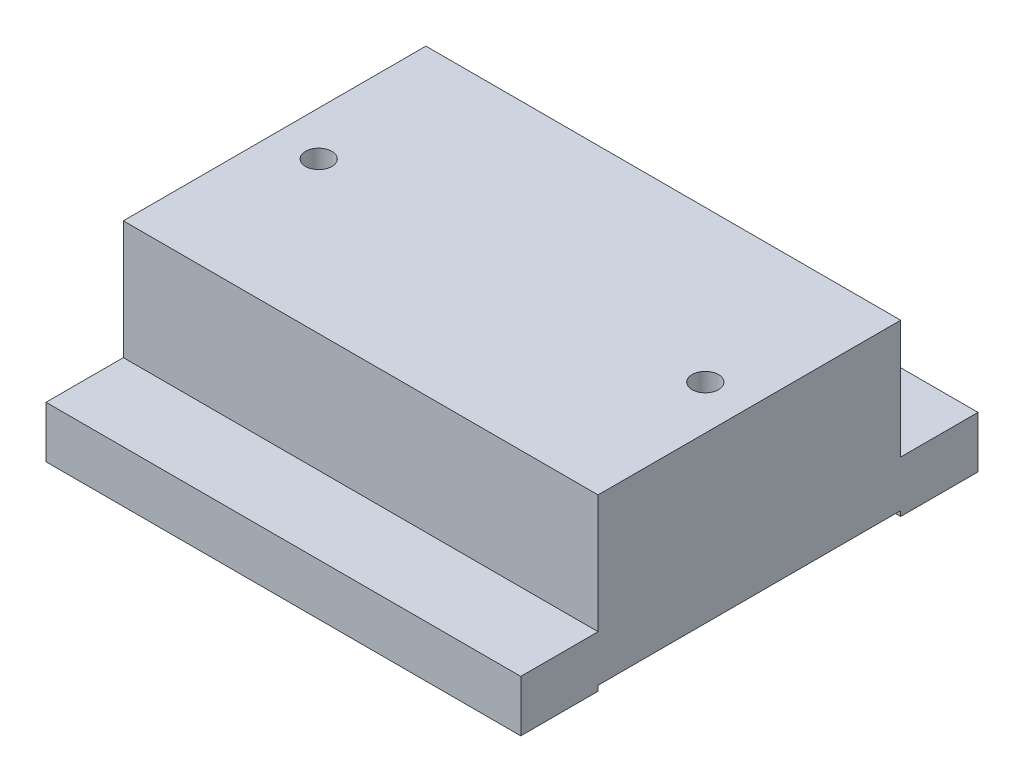
ISO-10303-21;
HEADER;
FILE_DESCRIPTION(('STEP AP214'),'2;1');
FILE_NAME('part.step','',(''),(''),'','','');
FILE_SCHEMA(('AUTOMOTIVE_DESIGN { 1 0 10303 214 1 1 1 1 }'));
ENDSEC;
DATA;
#1=APPLICATION_CONTEXT('core data for automotive mechanical design processes');
#2=APPLICATION_PROTOCOL_DEFINITION('international standard','automotive_design',2000,#1);
#3=PRODUCT_CONTEXT('',#1,'mechanical');
#4=PRODUCT('Part','Part','',(#3));
#5=PRODUCT_RELATED_PRODUCT_CATEGORY('part','',(#4));
#6=PRODUCT_DEFINITION_FORMATION('','',#4);
#7=PRODUCT_DEFINITION_CONTEXT('part definition',#1,'design');
#8=PRODUCT_DEFINITION('design','',#6,#7);
#9=PRODUCT_DEFINITION_SHAPE('','',#8);
#10=(LENGTH_UNIT() NAMED_UNIT(*) SI_UNIT(.MILLI.,.METRE.));
#11=(NAMED_UNIT(*) PLANE_ANGLE_UNIT() SI_UNIT($,.RADIAN.));
#12=(NAMED_UNIT(*) SI_UNIT($,.STERADIAN.) SOLID_ANGLE_UNIT());
#13=UNCERTAINTY_MEASURE_WITH_UNIT(LENGTH_MEASURE(1.E-05),#10,'distance_accuracy_value','');
#14=(GEOMETRIC_REPRESENTATION_CONTEXT(3) GLOBAL_UNCERTAINTY_ASSIGNED_CONTEXT((#13)) GLOBAL_UNIT_ASSIGNED_CONTEXT((#10,
#11,#12)) REPRESENTATION_CONTEXT('',''));
#15=CARTESIAN_POINT('',(0.,0.,0.));
#16=DIRECTION('',(0.,0.,1.));
#17=DIRECTION('',(1.,0.,0.));
#18=AXIS2_PLACEMENT_3D('',#15,#16,#17);
#19=CARTESIAN_POINT('',(46.05,0.,44.35));
#20=DIRECTION('',(0.,1.,0.));
#21=DIRECTION('',(0.,0.,1.));
#22=AXIS2_PLACEMENT_3D('',#19,#20,#21);
#23=PLANE('',#22);
#24=DIRECTION('',(0.,0.,-1.));
#25=VECTOR('',#24,1.);
#26=CARTESIAN_POINT('',(46.05,0.,-44.35));
#27=LINE('',#26,#25);
#28=CARTESIAN_POINT('',(46.05,0.,-29.35));
#29=VERTEX_POINT('',#28);
#30=CARTESIAN_POINT('',(46.05,0.,-44.35));
#31=VERTEX_POINT('',#30);
#32=EDGE_CURVE('E208',#29,#31,#27,.T.);
#33=ORIENTED_EDGE('',*,*,#32,.F.);
#34=DIRECTION('',(1.,0.,0.));
#35=VECTOR('',#34,1.);
#36=CARTESIAN_POINT('',(-46.05,0.,-29.35));
#37=LINE('',#36,#35);
#38=CARTESIAN_POINT('',(-46.05,0.,-29.35));
#39=VERTEX_POINT('',#38);
#40=EDGE_CURVE('E158',#39,#29,#37,.T.);
#41=ORIENTED_EDGE('',*,*,#40,.F.);
#42=DIRECTION('',(0.,0.,1.));
#43=VECTOR('',#42,1.);
#44=CARTESIAN_POINT('',(-46.05,0.,-44.35));
#45=LINE('',#44,#43);
#46=CARTESIAN_POINT('',(-46.05,0.,-44.35));
#47=VERTEX_POINT('',#46);
#48=EDGE_CURVE('E254',#47,#39,#45,.T.);
#49=ORIENTED_EDGE('',*,*,#48,.F.);
#50=DIRECTION('',(-1.,0.,0.));
#51=VECTOR('',#50,1.);
#52=CARTESIAN_POINT('',(-46.05,0.,-44.35));
#53=LINE('',#52,#51);
#54=EDGE_CURVE('E257',#31,#47,#53,.T.);
#55=ORIENTED_EDGE('',*,*,#54,.F.);
#56=EDGE_LOOP('',(#33,#41,#49,#55));
#57=FACE_BOUND('',#56,.T.);
#58=ADVANCED_FACE('F37',(#57),#23,.F.);
#59=CARTESIAN_POINT('',(46.05,10.,44.35));
#60=DIRECTION('',(0.,1.,0.));
#61=DIRECTION('',(0.,0.,1.));
#62=AXIS2_PLACEMENT_3D('',#59,#60,#61);
#63=PLANE('',#62);
#64=DIRECTION('',(1.,0.,0.));
#65=VECTOR('',#64,1.);
#66=CARTESIAN_POINT('',(-46.05,10.,29.35));
#67=LINE('',#66,#65);
#68=CARTESIAN_POINT('',(-46.05,10.,29.35));
#69=VERTEX_POINT('',#68);
#70=CARTESIAN_POINT('',(46.05,10.,29.35));
#71=VERTEX_POINT('',#70);
#72=EDGE_CURVE('E62',#69,#71,#67,.T.);
#73=ORIENTED_EDGE('',*,*,#72,.F.);
#74=DIRECTION('',(0.,0.,1.));
#75=VECTOR('',#74,1.);
#76=CARTESIAN_POINT('',(-46.05,10.,-44.35));
#77=LINE('',#76,#75);
#78=CARTESIAN_POINT('',(-46.05,10.,44.35));
#79=VERTEX_POINT('',#78);
#80=EDGE_CURVE('E196',#69,#79,#77,.T.);
#81=ORIENTED_EDGE('',*,*,#80,.T.);
#82=DIRECTION('',(1.,0.,0.));
#83=VECTOR('',#82,1.);
#84=CARTESIAN_POINT('',(-46.05,10.,44.35));
#85=LINE('',#84,#83);
#86=CARTESIAN_POINT('',(46.05,10.,44.35));
#87=VERTEX_POINT('',#86);
#88=EDGE_CURVE('E231',#79,#87,#85,.T.);
#89=ORIENTED_EDGE('',*,*,#88,.T.);
#90=DIRECTION('',(0.,0.,-1.));
#91=VECTOR('',#90,1.);
#92=CARTESIAN_POINT('',(46.05,10.,-44.35));
#93=LINE('',#92,#91);
#94=EDGE_CURVE('E232',#87,#71,#93,.T.);
#95=ORIENTED_EDGE('',*,*,#94,.T.);
#96=EDGE_LOOP('',(#73,#81,#89,#95));
#97=FACE_BOUND('',#96,.T.);
#98=ADVANCED_FACE('F298',(#97),#63,.T.);
#99=CARTESIAN_POINT('',(46.05,10.,-44.35));
#100=DIRECTION('',(-1.,0.,0.));
#101=DIRECTION('',(0.,0.,1.));
#102=AXIS2_PLACEMENT_3D('',#99,#100,#101);
#103=PLANE('',#102);
#104=DIRECTION('',(0.,0.,1.));
#105=VECTOR('',#104,1.);
#106=CARTESIAN_POINT('',(46.05,1.,29.35));
#107=LINE('',#106,#105);
#108=CARTESIAN_POINT('',(46.05,1.,-29.35));
#109=VERTEX_POINT('',#108);
#110=CARTESIAN_POINT('',(46.05,1.,29.35));
#111=VERTEX_POINT('',#110);
#112=EDGE_CURVE('E154',#109,#111,#107,.T.);
#113=ORIENTED_EDGE('',*,*,#112,.F.);
#114=DIRECTION('',(0.,-1.,0.));
#115=VECTOR('',#114,1.);
#116=CARTESIAN_POINT('',(46.05,1.,-29.35));
#117=LINE('',#116,#115);
#118=EDGE_CURVE('E168',#109,#29,#117,.T.);
#119=ORIENTED_EDGE('',*,*,#118,.T.);
#120=ORIENTED_EDGE('',*,*,#32,.T.);
#121=DIRECTION('',(0.,-1.,0.));
#122=VECTOR('',#121,1.);
#123=CARTESIAN_POINT('',(46.05,10.,-44.35));
#124=LINE('',#123,#122);
#125=CARTESIAN_POINT('',(46.05,10.,-44.35));
#126=VERTEX_POINT('',#125);
#127=EDGE_CURVE('E11',#126,#31,#124,.T.);
#128=ORIENTED_EDGE('',*,*,#127,.F.);
#129=CARTESIAN_POINT('',(46.05,10.,-29.35));
#130=VERTEX_POINT('',#129);
#131=EDGE_CURVE('E237',#130,#126,#93,.T.);
#132=ORIENTED_EDGE('',*,*,#131,.F.);
#133=DIRECTION('',(0.,-1.,0.));
#134=VECTOR('',#133,1.);
#135=CARTESIAN_POINT('',(46.05,32.986,-29.35));
#136=LINE('',#135,#134);
#137=CARTESIAN_POINT('',(46.05,32.986,-29.35));
#138=VERTEX_POINT('',#137);
#139=EDGE_CURVE('E202',#138,#130,#136,.T.);
#140=ORIENTED_EDGE('',*,*,#139,.F.);
#141=DIRECTION('',(0.,0.,-1.));
#142=VECTOR('',#141,1.);
#143=CARTESIAN_POINT('',(46.05,32.986,-29.35));
#144=LINE('',#143,#142);
#145=CARTESIAN_POINT('',(46.05,32.986,29.35));
#146=VERTEX_POINT('',#145);
#147=EDGE_CURVE('E178',#146,#138,#144,.T.);
#148=ORIENTED_EDGE('',*,*,#147,.F.);
#149=DIRECTION('',(0.,-1.,0.));
#150=VECTOR('',#149,1.);
#151=CARTESIAN_POINT('',(46.05,32.986,29.35));
#152=LINE('',#151,#150);
#153=EDGE_CURVE('E187',#146,#71,#152,.T.);
#154=ORIENTED_EDGE('',*,*,#153,.T.);
#155=ORIENTED_EDGE('',*,*,#94,.F.);
#156=DIRECTION('',(0.,-1.,0.));
#157=VECTOR('',#156,1.);
#158=CARTESIAN_POINT('',(46.05,10.,44.35));
#159=LINE('',#158,#157);
#160=CARTESIAN_POINT('',(46.05,0.,44.35));
#161=VERTEX_POINT('',#160);
#162=EDGE_CURVE('E250',#87,#161,#159,.T.);
#163=ORIENTED_EDGE('',*,*,#162,.T.);
#164=CARTESIAN_POINT('',(46.05,0.,29.35));
#165=VERTEX_POINT('',#164);
#166=EDGE_CURVE('E258',#161,#165,#27,.T.);
#167=ORIENTED_EDGE('',*,*,#166,.T.);
#168=DIRECTION('',(0.,-1.,0.));
#169=VECTOR('',#168,1.);
#170=CARTESIAN_POINT('',(46.05,1.,29.35));
#171=LINE('',#170,#169);
#172=EDGE_CURVE('E54',#111,#165,#171,.T.);
#173=ORIENTED_EDGE('',*,*,#172,.F.);
#174=EDGE_LOOP('',(#113,#119,#120,#128,#132,#140,#148,#154,#155,#163,#167,#173));
#175=FACE_BOUND('',#174,.T.);
#176=ADVANCED_FACE('F39',(#175),#103,.F.);
#177=CARTESIAN_POINT('',(-46.05,10.,-44.35));
#178=DIRECTION('',(0.,0.,1.));
#179=DIRECTION('',(1.,0.,0.));
#180=AXIS2_PLACEMENT_3D('',#177,#178,#179);
#181=PLANE('',#180);
#182=ORIENTED_EDGE('',*,*,#54,.T.);
#183=DIRECTION('',(0.,-1.,0.));
#184=VECTOR('',#183,1.);
#185=CARTESIAN_POINT('',(-46.05,10.,-44.35));
#186=LINE('',#185,#184);
#187=CARTESIAN_POINT('',(-46.05,10.,-44.35));
#188=VERTEX_POINT('',#187);
#189=EDGE_CURVE('E46',#188,#47,#186,.T.);
#190=ORIENTED_EDGE('',*,*,#189,.F.);
#191=DIRECTION('',(-1.,0.,0.));
#192=VECTOR('',#191,1.);
#193=CARTESIAN_POINT('',(-46.05,10.,-44.35));
#194=LINE('',#193,#192);
#195=EDGE_CURVE('E230',#126,#188,#194,.T.);
#196=ORIENTED_EDGE('',*,*,#195,.F.);
#197=ORIENTED_EDGE('',*,*,#127,.T.);
#198=EDGE_LOOP('',(#182,#190,#196,#197));
#199=FACE_BOUND('',#198,.T.);
#200=ADVANCED_FACE('F271',(#199),#181,.F.);
#201=CARTESIAN_POINT('',(-46.05,10.,-44.35));
#202=DIRECTION('',(1.,0.,0.));
#203=DIRECTION('',(0.,0.,-1.));
#204=AXIS2_PLACEMENT_3D('',#201,#202,#203);
#205=PLANE('',#204);
#206=ORIENTED_EDGE('',*,*,#48,.T.);
#207=DIRECTION('',(0.,-1.,0.));
#208=VECTOR('',#207,1.);
#209=CARTESIAN_POINT('',(-46.05,1.,-29.35));
#210=LINE('',#209,#208);
#211=CARTESIAN_POINT('',(-46.05,1.,-29.35));
#212=VERTEX_POINT('',#211);
#213=EDGE_CURVE('E172',#212,#39,#210,.T.);
#214=ORIENTED_EDGE('',*,*,#213,.F.);
#215=DIRECTION('',(0.,0.,-1.));
#216=VECTOR('',#215,1.);
#217=CARTESIAN_POINT('',(-46.05,1.,29.35));
#218=LINE('',#217,#216);
#219=CARTESIAN_POINT('',(-46.05,1.,29.35));
#220=VERTEX_POINT('',#219);
#221=EDGE_CURVE('E161',#220,#212,#218,.T.);
#222=ORIENTED_EDGE('',*,*,#221,.F.);
#223=DIRECTION('',(0.,-1.,0.));
#224=VECTOR('',#223,1.);
#225=CARTESIAN_POINT('',(-46.05,1.,29.35));
#226=LINE('',#225,#224);
#227=CARTESIAN_POINT('',(-46.05,0.,29.35));
#228=VERTEX_POINT('',#227);
#229=EDGE_CURVE('E174',#220,#228,#226,.T.);
#230=ORIENTED_EDGE('',*,*,#229,.T.);
#231=CARTESIAN_POINT('',(-46.05,0.,44.35));
#232=VERTEX_POINT('',#231);
#233=EDGE_CURVE('E256',#228,#232,#45,.T.);
#234=ORIENTED_EDGE('',*,*,#233,.T.);
#235=DIRECTION('',(0.,-1.,0.));
#236=VECTOR('',#235,1.);
#237=CARTESIAN_POINT('',(-46.05,10.,44.35));
#238=LINE('',#237,#236);
#239=EDGE_CURVE('E227',#79,#232,#238,.T.);
#240=ORIENTED_EDGE('',*,*,#239,.F.);
#241=ORIENTED_EDGE('',*,*,#80,.F.);
#242=DIRECTION('',(0.,-1.,0.));
#243=VECTOR('',#242,1.);
#244=CARTESIAN_POINT('',(-46.05,32.986,29.35));
#245=LINE('',#244,#243);
#246=CARTESIAN_POINT('',(-46.05,32.986,29.35));
#247=VERTEX_POINT('',#246);
#248=EDGE_CURVE('E203',#247,#69,#245,.T.);
#249=ORIENTED_EDGE('',*,*,#248,.F.);
#250=DIRECTION('',(0.,0.,1.));
#251=VECTOR('',#250,1.);
#252=CARTESIAN_POINT('',(-46.05,32.986,-29.35));
#253=LINE('',#252,#251);
#254=CARTESIAN_POINT('',(-46.05,32.986,-29.35));
#255=VERTEX_POINT('',#254);
#256=EDGE_CURVE('E183',#255,#247,#253,.T.);
#257=ORIENTED_EDGE('',*,*,#256,.F.);
#258=DIRECTION('',(0.,-1.,0.));
#259=VECTOR('',#258,1.);
#260=CARTESIAN_POINT('',(-46.05,32.986,-29.35));
#261=LINE('',#260,#259);
#262=CARTESIAN_POINT('',(-46.05,10.,-29.35));
#263=VERTEX_POINT('',#262);
#264=EDGE_CURVE('E199',#255,#263,#261,.T.);
#265=ORIENTED_EDGE('',*,*,#264,.T.);
#266=EDGE_CURVE('E229',#188,#263,#77,.T.);
#267=ORIENTED_EDGE('',*,*,#266,.F.);
#268=ORIENTED_EDGE('',*,*,#189,.T.);
#269=EDGE_LOOP('',(#206,#214,#222,#230,#234,#240,#241,#249,#257,#265,#267,#268));
#270=FACE_BOUND('',#269,.T.);
#271=ADVANCED_FACE('F224',(#270),#205,.F.);
#272=CARTESIAN_POINT('',(-46.05,10.,44.35));
#273=DIRECTION('',(0.,0.,-1.));
#274=DIRECTION('',(-1.,0.,0.));
#275=AXIS2_PLACEMENT_3D('',#272,#273,#274);
#276=PLANE('',#275);
#277=DIRECTION('',(1.,0.,0.));
#278=VECTOR('',#277,1.);
#279=CARTESIAN_POINT('',(-46.05,0.,44.35));
#280=LINE('',#279,#278);
#281=EDGE_CURVE('E245',#232,#161,#280,.T.);
#282=ORIENTED_EDGE('',*,*,#281,.T.);
#283=ORIENTED_EDGE('',*,*,#162,.F.);
#284=ORIENTED_EDGE('',*,*,#88,.F.);
#285=ORIENTED_EDGE('',*,*,#239,.T.);
#286=EDGE_LOOP('',(#282,#283,#284,#285));
#287=FACE_BOUND('',#286,.T.);
#288=ADVANCED_FACE('F313',(#287),#276,.F.);
#289=DIRECTION('',(-1.,0.,0.));
#290=VECTOR('',#289,1.);
#291=CARTESIAN_POINT('',(-46.05,10.,-29.35));
#292=LINE('',#291,#290);
#293=EDGE_CURVE('E171',#130,#263,#292,.T.);
#294=ORIENTED_EDGE('',*,*,#293,.F.);
#295=ORIENTED_EDGE('',*,*,#131,.T.);
#296=ORIENTED_EDGE('',*,*,#195,.T.);
#297=ORIENTED_EDGE('',*,*,#266,.T.);
#298=EDGE_LOOP('',(#294,#295,#296,#297));
#299=FACE_BOUND('',#298,.T.);
#300=ADVANCED_FACE('F274',(#299),#63,.T.);
#301=ORIENTED_EDGE('',*,*,#233,.F.);
#302=DIRECTION('',(-1.,0.,0.));
#303=VECTOR('',#302,1.);
#304=CARTESIAN_POINT('',(-46.05,0.,29.35));
#305=LINE('',#304,#303);
#306=EDGE_CURVE('E153',#165,#228,#305,.T.);
#307=ORIENTED_EDGE('',*,*,#306,.F.);
#308=ORIENTED_EDGE('',*,*,#166,.F.);
#309=ORIENTED_EDGE('',*,*,#281,.F.);
#310=EDGE_LOOP('',(#301,#307,#308,#309));
#311=FACE_BOUND('',#310,.T.);
#312=ADVANCED_FACE('F300',(#311),#23,.F.);
#313=CARTESIAN_POINT('',(-46.05,32.986,-29.35));
#314=DIRECTION('',(0.,0.,1.));
#315=DIRECTION('',(1.,0.,0.));
#316=AXIS2_PLACEMENT_3D('',#313,#314,#315);
#317=PLANE('',#316);
#318=ORIENTED_EDGE('',*,*,#293,.T.);
#319=ORIENTED_EDGE('',*,*,#264,.F.);
#320=DIRECTION('',(-1.,0.,0.));
#321=VECTOR('',#320,1.);
#322=CARTESIAN_POINT('',(-46.05,32.986,-29.35));
#323=LINE('',#322,#321);
#324=EDGE_CURVE('E181',#138,#255,#323,.T.);
#325=ORIENTED_EDGE('',*,*,#324,.F.);
#326=ORIENTED_EDGE('',*,*,#139,.T.);
#327=EDGE_LOOP('',(#318,#319,#325,#326));
#328=FACE_BOUND('',#327,.T.);
#329=ADVANCED_FACE('F276',(#328),#317,.F.);
#330=CARTESIAN_POINT('',(-46.05,32.986,29.35));
#331=DIRECTION('',(0.,0.,-1.));
#332=DIRECTION('',(-1.,0.,0.));
#333=AXIS2_PLACEMENT_3D('',#330,#331,#332);
#334=PLANE('',#333);
#335=ORIENTED_EDGE('',*,*,#72,.T.);
#336=ORIENTED_EDGE('',*,*,#153,.F.);
#337=DIRECTION('',(1.,0.,0.));
#338=VECTOR('',#337,1.);
#339=CARTESIAN_POINT('',(-46.05,32.986,29.35));
#340=LINE('',#339,#338);
#341=EDGE_CURVE('E185',#247,#146,#340,.T.);
#342=ORIENTED_EDGE('',*,*,#341,.F.);
#343=ORIENTED_EDGE('',*,*,#248,.T.);
#344=EDGE_LOOP('',(#335,#336,#342,#343));
#345=FACE_BOUND('',#344,.T.);
#346=ADVANCED_FACE('F219',(#345),#334,.F.);
#347=CARTESIAN_POINT('',(46.05,32.986,29.35));
#348=DIRECTION('',(0.,1.,0.));
#349=DIRECTION('',(0.,0.,1.));
#350=AXIS2_PLACEMENT_3D('',#347,#348,#349);
#351=PLANE('',#350);
#352=CARTESIAN_POINT('',(-37.5,32.986,0.));
#353=DIRECTION('',(0.,1.,0.));
#354=DIRECTION('',(0.,0.,1.));
#355=AXIS2_PLACEMENT_3D('',#352,#353,#354);
#356=CIRCLE('',#355,2.55269999999999);
#357=CARTESIAN_POINT('',(-37.5,32.986,2.55269999999999));
#358=VERTEX_POINT('',#357);
#359=EDGE_CURVE('E143',#358,#358,#356,.T.);
#360=ORIENTED_EDGE('',*,*,#359,.F.);
#361=EDGE_LOOP('',(#360));
#362=FACE_BOUND('',#361,.T.);
#363=CARTESIAN_POINT('',(37.5,32.986,0.));
#364=DIRECTION('',(0.,1.,0.));
#365=DIRECTION('',(0.,0.,1.));
#366=AXIS2_PLACEMENT_3D('',#363,#364,#365);
#367=CIRCLE('',#366,2.55269999999999);
#368=CARTESIAN_POINT('',(37.5,32.986,2.55269999999999));
#369=VERTEX_POINT('',#368);
#370=EDGE_CURVE('E142',#369,#369,#367,.T.);
#371=ORIENTED_EDGE('',*,*,#370,.F.);
#372=EDGE_LOOP('',(#371));
#373=FACE_BOUND('',#372,.T.);
#374=ORIENTED_EDGE('',*,*,#147,.T.);
#375=ORIENTED_EDGE('',*,*,#324,.T.);
#376=ORIENTED_EDGE('',*,*,#256,.T.);
#377=ORIENTED_EDGE('',*,*,#341,.T.);
#378=EDGE_LOOP('',(#374,#375,#376,#377));
#379=FACE_BOUND('',#378,.T.);
#380=ADVANCED_FACE('F281',(#362,#373,#379),#351,.T.);
#381=CARTESIAN_POINT('',(-46.05,1.,-29.35));
#382=DIRECTION('',(0.,0.,-1.));
#383=DIRECTION('',(-1.,0.,0.));
#384=AXIS2_PLACEMENT_3D('',#381,#382,#383);
#385=PLANE('',#384);
#386=ORIENTED_EDGE('',*,*,#40,.T.);
#387=ORIENTED_EDGE('',*,*,#118,.F.);
#388=DIRECTION('',(1.,0.,0.));
#389=VECTOR('',#388,1.);
#390=CARTESIAN_POINT('',(-46.05,1.,-29.35));
#391=LINE('',#390,#389);
#392=EDGE_CURVE('E163',#212,#109,#391,.T.);
#393=ORIENTED_EDGE('',*,*,#392,.F.);
#394=ORIENTED_EDGE('',*,*,#213,.T.);
#395=EDGE_LOOP('',(#386,#387,#393,#394));
#396=FACE_BOUND('',#395,.T.);
#397=ADVANCED_FACE('F283',(#396),#385,.F.);
#398=CARTESIAN_POINT('',(-46.05,1.,29.35));
#399=DIRECTION('',(0.,0.,1.));
#400=DIRECTION('',(1.,0.,0.));
#401=AXIS2_PLACEMENT_3D('',#398,#399,#400);
#402=PLANE('',#401);
#403=ORIENTED_EDGE('',*,*,#306,.T.);
#404=ORIENTED_EDGE('',*,*,#229,.F.);
#405=DIRECTION('',(-1.,0.,0.));
#406=VECTOR('',#405,1.);
#407=CARTESIAN_POINT('',(-46.05,1.,29.35));
#408=LINE('',#407,#406);
#409=EDGE_CURVE('E157',#111,#220,#408,.T.);
#410=ORIENTED_EDGE('',*,*,#409,.F.);
#411=ORIENTED_EDGE('',*,*,#172,.T.);
#412=EDGE_LOOP('',(#403,#404,#410,#411));
#413=FACE_BOUND('',#412,.T.);
#414=ADVANCED_FACE('F290',(#413),#402,.F.);
#415=CARTESIAN_POINT('',(46.05,1.,-29.35));
#416=DIRECTION('',(0.,-1.,0.));
#417=DIRECTION('',(0.,0.,-1.));
#418=AXIS2_PLACEMENT_3D('',#415,#416,#417);
#419=PLANE('',#418);
#420=ORIENTED_EDGE('',*,*,#112,.T.);
#421=ORIENTED_EDGE('',*,*,#409,.T.);
#422=ORIENTED_EDGE('',*,*,#221,.T.);
#423=ORIENTED_EDGE('',*,*,#392,.T.);
#424=EDGE_LOOP('',(#420,#421,#422,#423));
#425=FACE_BOUND('',#424,.T.);
#426=ADVANCED_FACE('F379',(#425),#419,.T.);
#427=CARTESIAN_POINT('',(37.5,16.476,0.));
#428=DIRECTION('',(0.,1.,0.));
#429=DIRECTION('',(0.,0.,1.));
#430=AXIS2_PLACEMENT_3D('',#427,#428,#429);
#431=CONICAL_SURFACE('',#430,2.55269999999998,1.02974425867665);
#432=CARTESIAN_POINT('',(37.5,14.9421830978084,0.));
#433=VERTEX_POINT('',#432);
#434=VERTEX_LOOP('',#433);
#435=FACE_BOUND('',#434,.T.);
#436=CARTESIAN_POINT('',(37.5,16.476,0.));
#437=DIRECTION('',(0.,1.,0.));
#438=DIRECTION('',(0.,0.,1.));
#439=AXIS2_PLACEMENT_3D('',#436,#437,#438);
#440=CIRCLE('',#439,2.55269999999998);
#441=CARTESIAN_POINT('',(37.5,16.476,2.55269999999998));
#442=VERTEX_POINT('',#441);
#443=EDGE_CURVE('E146',#442,#442,#440,.T.);
#444=ORIENTED_EDGE('',*,*,#443,.T.);
#445=EDGE_LOOP('',(#444));
#446=FACE_BOUND('',#445,.T.);
#447=ADVANCED_FACE('F386',(#435,#446),#431,.F.);
#448=CARTESIAN_POINT('',(37.5,32.986,0.));
#449=DIRECTION('',(0.,1.,0.));
#450=DIRECTION('',(0.,0.,1.));
#451=AXIS2_PLACEMENT_3D('',#448,#449,#450);
#452=CYLINDRICAL_SURFACE('',#451,2.55269999999999);
#453=ORIENTED_EDGE('',*,*,#443,.F.);
#454=EDGE_LOOP('',(#453));
#455=FACE_BOUND('',#454,.T.);
#456=ORIENTED_EDGE('',*,*,#370,.T.);
#457=EDGE_LOOP('',(#456));
#458=FACE_BOUND('',#457,.T.);
#459=ADVANCED_FACE('F136',(#455,#458),#452,.F.);
#460=CARTESIAN_POINT('',(-37.5,16.476,0.));
#461=DIRECTION('',(0.,1.,0.));
#462=DIRECTION('',(0.,0.,1.));
#463=AXIS2_PLACEMENT_3D('',#460,#461,#462);
#464=CONICAL_SURFACE('',#463,2.55269999999998,1.02974425867665);
#465=CARTESIAN_POINT('',(-37.5,14.9421830978084,0.));
#466=VERTEX_POINT('',#465);
#467=VERTEX_LOOP('',#466);
#468=FACE_BOUND('',#467,.T.);
#469=CARTESIAN_POINT('',(-37.5,16.476,0.));
#470=DIRECTION('',(0.,1.,0.));
#471=DIRECTION('',(0.,0.,1.));
#472=AXIS2_PLACEMENT_3D('',#469,#470,#471);
#473=CIRCLE('',#472,2.55269999999998);
#474=CARTESIAN_POINT('',(-37.5,16.476,2.55269999999998));
#475=VERTEX_POINT('',#474);
#476=EDGE_CURVE('E140',#475,#475,#473,.T.);
#477=ORIENTED_EDGE('',*,*,#476,.T.);
#478=EDGE_LOOP('',(#477));
#479=FACE_BOUND('',#478,.T.);
#480=ADVANCED_FACE('F132',(#468,#479),#464,.F.);
#481=CARTESIAN_POINT('',(-37.5,32.986,0.));
#482=DIRECTION('',(0.,1.,0.));
#483=DIRECTION('',(0.,0.,1.));
#484=AXIS2_PLACEMENT_3D('',#481,#482,#483);
#485=CYLINDRICAL_SURFACE('',#484,2.55269999999999);
#486=ORIENTED_EDGE('',*,*,#476,.F.);
#487=EDGE_LOOP('',(#486));
#488=FACE_BOUND('',#487,.T.);
#489=ORIENTED_EDGE('',*,*,#359,.T.);
#490=EDGE_LOOP('',(#489));
#491=FACE_BOUND('',#490,.T.);
#492=ADVANCED_FACE('F135',(#488,#491),#485,.F.);
#493=CLOSED_SHELL('',(#58,#98,#176,#200,#271,#288,#300,#312,#329,#346,#380,#397,#414,#426,#447,
#459,#480,#492));
#494=MANIFOLD_SOLID_BREP('B2',#493);
#495=ADVANCED_BREP_SHAPE_REPRESENTATION('',(#18,#494),#14);
#496=SHAPE_DEFINITION_REPRESENTATION(#9,#495);
ENDSEC;
END-ISO-10303-21;
